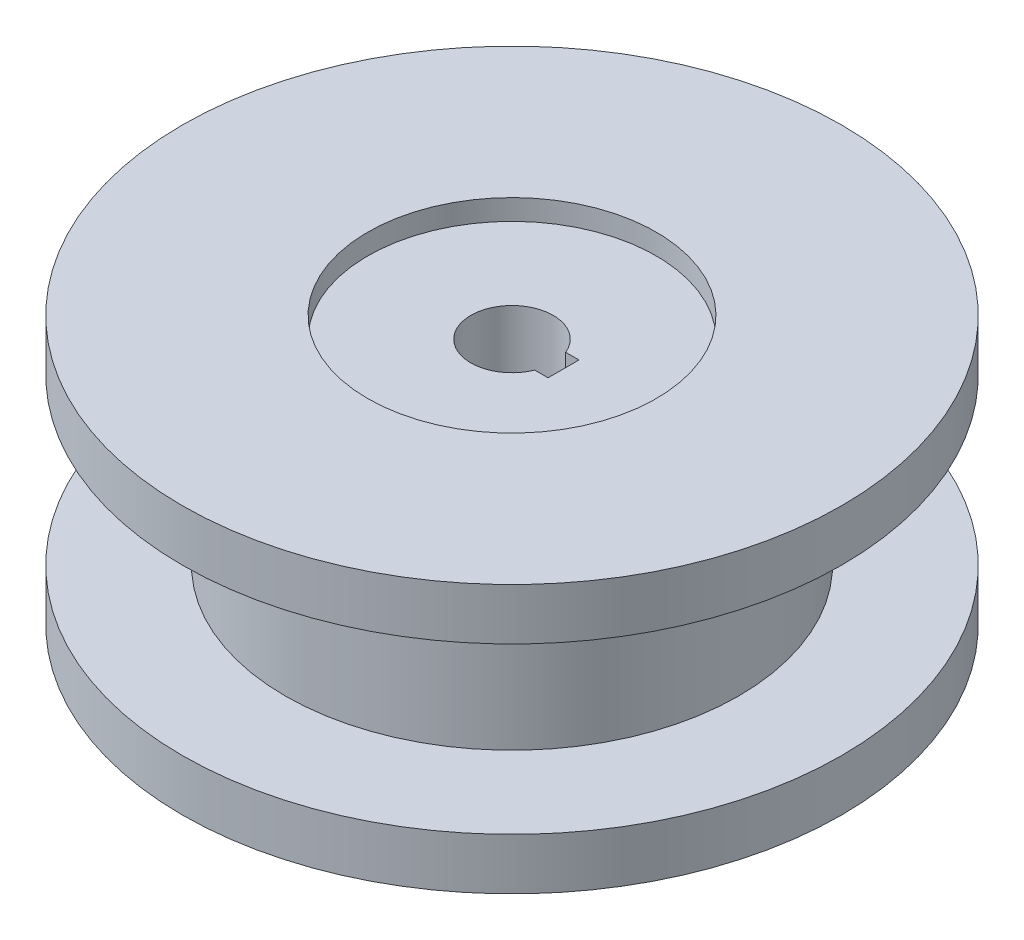
ISO-10303-21;
HEADER;
FILE_DESCRIPTION(('STEP AP214'),'2;1');
FILE_NAME('part.step','',(''),(''),'','','');
FILE_SCHEMA(('AUTOMOTIVE_DESIGN { 1 0 10303 214 1 1 1 1 }'));
ENDSEC;
DATA;
#1=APPLICATION_CONTEXT('core data for automotive mechanical design processes');
#2=APPLICATION_PROTOCOL_DEFINITION('international standard','automotive_design',2000,#1);
#3=PRODUCT_CONTEXT('',#1,'mechanical');
#4=PRODUCT('Part','Part','',(#3));
#5=PRODUCT_RELATED_PRODUCT_CATEGORY('part','',(#4));
#6=PRODUCT_DEFINITION_FORMATION('','',#4);
#7=PRODUCT_DEFINITION_CONTEXT('part definition',#1,'design');
#8=PRODUCT_DEFINITION('design','',#6,#7);
#9=PRODUCT_DEFINITION_SHAPE('','',#8);
#10=(LENGTH_UNIT() NAMED_UNIT(*) SI_UNIT(.MILLI.,.METRE.));
#11=(NAMED_UNIT(*) PLANE_ANGLE_UNIT() SI_UNIT($,.RADIAN.));
#12=(NAMED_UNIT(*) SI_UNIT($,.STERADIAN.) SOLID_ANGLE_UNIT());
#13=UNCERTAINTY_MEASURE_WITH_UNIT(LENGTH_MEASURE(1.E-05),#10,'distance_accuracy_value','');
#14=(GEOMETRIC_REPRESENTATION_CONTEXT(3) GLOBAL_UNCERTAINTY_ASSIGNED_CONTEXT((#13)) GLOBAL_UNIT_ASSIGNED_CONTEXT((#10,
#11,#12)) REPRESENTATION_CONTEXT('',''));
#15=CARTESIAN_POINT('',(0.,0.,0.));
#16=DIRECTION('',(0.,0.,1.));
#17=DIRECTION('',(1.,0.,0.));
#18=AXIS2_PLACEMENT_3D('',#15,#16,#17);
#19=CARTESIAN_POINT('',(0.,-65.,0.));
#20=DIRECTION('',(0.,1.,0.));
#21=DIRECTION('',(0.,0.,1.));
#22=AXIS2_PLACEMENT_3D('',#19,#20,#21);
#23=PLANE('',#22);
#24=CARTESIAN_POINT('',(0.,-65.,0.));
#25=DIRECTION('',(0.,1.,0.));
#26=DIRECTION('',(0.,0.,1.));
#27=AXIS2_PLACEMENT_3D('',#24,#25,#26);
#28=CIRCLE('',#27,70.);
#29=CARTESIAN_POINT('',(0.,-65.,70.));
#30=VERTEX_POINT('',#29);
#31=EDGE_CURVE('E105',#30,#30,#28,.T.);
#32=ORIENTED_EDGE('',*,*,#31,.T.);
#33=EDGE_LOOP('',(#32));
#34=FACE_BOUND('',#33,.T.);
#35=CARTESIAN_POINT('',(0.,-65.,0.));
#36=DIRECTION('',(0.,1.,0.));
#37=DIRECTION('',(0.,0.,1.));
#38=AXIS2_PLACEMENT_3D('',#35,#36,#37);
#39=CIRCLE('',#38,160.);
#40=CARTESIAN_POINT('',(0.,-65.,160.));
#41=VERTEX_POINT('',#40);
#42=EDGE_CURVE('E128',#41,#41,#39,.T.);
#43=ORIENTED_EDGE('',*,*,#42,.F.);
#44=EDGE_LOOP('',(#43));
#45=FACE_BOUND('',#44,.T.);
#46=ADVANCED_FACE('F33',(#34,#45),#23,.F.);
#47=CARTESIAN_POINT('',(0.,93.8108108108108,0.));
#48=DIRECTION('',(0.,1.,0.));
#49=DIRECTION('',(0.,0.,1.));
#50=AXIS2_PLACEMENT_3D('',#47,#48,#49);
#51=CYLINDRICAL_SURFACE('',#50,160.);
#52=CARTESIAN_POINT('',(0.,-40.,0.));
#53=DIRECTION('',(0.,1.,0.));
#54=DIRECTION('',(0.,0.,1.));
#55=AXIS2_PLACEMENT_3D('',#52,#53,#54);
#56=CIRCLE('',#55,160.);
#57=CARTESIAN_POINT('',(0.,-40.,160.));
#58=VERTEX_POINT('',#57);
#59=EDGE_CURVE('E125',#58,#58,#56,.T.);
#60=ORIENTED_EDGE('',*,*,#59,.F.);
#61=EDGE_LOOP('',(#60));
#62=FACE_BOUND('',#61,.T.);
#63=ORIENTED_EDGE('',*,*,#42,.T.);
#64=EDGE_LOOP('',(#63));
#65=FACE_BOUND('',#64,.T.);
#66=ADVANCED_FACE('F150',(#62,#65),#51,.T.);
#67=CARTESIAN_POINT('',(160.,-40.,0.));
#68=DIRECTION('',(0.,-1.,0.));
#69=DIRECTION('',(0.,0.,-1.));
#70=AXIS2_PLACEMENT_3D('',#67,#68,#69);
#71=PLANE('',#70);
#72=CARTESIAN_POINT('',(0.,-40.,0.));
#73=DIRECTION('',(0.,1.,0.));
#74=DIRECTION('',(0.,0.,1.));
#75=AXIS2_PLACEMENT_3D('',#72,#73,#74);
#76=CIRCLE('',#75,110.);
#77=CARTESIAN_POINT('',(0.,-40.,110.));
#78=VERTEX_POINT('',#77);
#79=EDGE_CURVE('E122',#78,#78,#76,.T.);
#80=ORIENTED_EDGE('',*,*,#79,.F.);
#81=EDGE_LOOP('',(#80));
#82=FACE_BOUND('',#81,.T.);
#83=ORIENTED_EDGE('',*,*,#59,.T.);
#84=EDGE_LOOP('',(#83));
#85=FACE_BOUND('',#84,.T.);
#86=ADVANCED_FACE('F155',(#82,#85),#71,.F.);
#87=CARTESIAN_POINT('',(0.,93.8108108108108,0.));
#88=DIRECTION('',(0.,1.,0.));
#89=DIRECTION('',(0.,0.,1.));
#90=AXIS2_PLACEMENT_3D('',#87,#88,#89);
#91=CYLINDRICAL_SURFACE('',#90,110.);
#92=CARTESIAN_POINT('',(0.,40.,0.));
#93=DIRECTION('',(0.,1.,0.));
#94=DIRECTION('',(0.,0.,1.));
#95=AXIS2_PLACEMENT_3D('',#92,#93,#94);
#96=CIRCLE('',#95,110.);
#97=CARTESIAN_POINT('',(0.,40.,110.));
#98=VERTEX_POINT('',#97);
#99=EDGE_CURVE('E119',#98,#98,#96,.T.);
#100=ORIENTED_EDGE('',*,*,#99,.F.);
#101=EDGE_LOOP('',(#100));
#102=FACE_BOUND('',#101,.T.);
#103=ORIENTED_EDGE('',*,*,#79,.T.);
#104=EDGE_LOOP('',(#103));
#105=FACE_BOUND('',#104,.T.);
#106=ADVANCED_FACE('F189',(#102,#105),#91,.T.);
#107=CARTESIAN_POINT('',(160.,40.,0.));
#108=DIRECTION('',(0.,1.,0.));
#109=DIRECTION('',(0.,0.,1.));
#110=AXIS2_PLACEMENT_3D('',#107,#108,#109);
#111=PLANE('',#110);
#112=CARTESIAN_POINT('',(0.,40.,0.));
#113=DIRECTION('',(0.,1.,0.));
#114=DIRECTION('',(0.,0.,1.));
#115=AXIS2_PLACEMENT_3D('',#112,#113,#114);
#116=CIRCLE('',#115,160.);
#117=CARTESIAN_POINT('',(0.,40.,160.));
#118=VERTEX_POINT('',#117);
#119=EDGE_CURVE('E116',#118,#118,#116,.T.);
#120=ORIENTED_EDGE('',*,*,#119,.F.);
#121=EDGE_LOOP('',(#120));
#122=FACE_BOUND('',#121,.T.);
#123=ORIENTED_EDGE('',*,*,#99,.T.);
#124=EDGE_LOOP('',(#123));
#125=FACE_BOUND('',#124,.T.);
#126=ADVANCED_FACE('F185',(#122,#125),#111,.F.);
#127=CARTESIAN_POINT('',(0.,93.8108108108108,0.));
#128=DIRECTION('',(0.,1.,0.));
#129=DIRECTION('',(0.,0.,1.));
#130=AXIS2_PLACEMENT_3D('',#127,#128,#129);
#131=CYLINDRICAL_SURFACE('',#130,160.);
#132=CARTESIAN_POINT('',(0.,65.,0.));
#133=DIRECTION('',(0.,1.,0.));
#134=DIRECTION('',(0.,0.,1.));
#135=AXIS2_PLACEMENT_3D('',#132,#133,#134);
#136=CIRCLE('',#135,160.);
#137=CARTESIAN_POINT('',(0.,65.,160.));
#138=VERTEX_POINT('',#137);
#139=EDGE_CURVE('E111',#138,#138,#136,.T.);
#140=ORIENTED_EDGE('',*,*,#139,.F.);
#141=EDGE_LOOP('',(#140));
#142=FACE_BOUND('',#141,.T.);
#143=ORIENTED_EDGE('',*,*,#119,.T.);
#144=EDGE_LOOP('',(#143));
#145=FACE_BOUND('',#144,.T.);
#146=ADVANCED_FACE('F181',(#142,#145),#131,.T.);
#147=CARTESIAN_POINT('',(0.,65.,0.));
#148=DIRECTION('',(0.,-1.,0.));
#149=DIRECTION('',(0.,0.,-1.));
#150=AXIS2_PLACEMENT_3D('',#147,#148,#149);
#151=PLANE('',#150);
#152=CARTESIAN_POINT('',(0.,65.,0.));
#153=DIRECTION('',(0.,1.,0.));
#154=DIRECTION('',(0.,0.,1.));
#155=AXIS2_PLACEMENT_3D('',#152,#153,#154);
#156=CIRCLE('',#155,70.);
#157=CARTESIAN_POINT('',(0.,65.,70.));
#158=VERTEX_POINT('',#157);
#159=EDGE_CURVE('E104',#158,#158,#156,.T.);
#160=ORIENTED_EDGE('',*,*,#159,.F.);
#161=EDGE_LOOP('',(#160));
#162=FACE_BOUND('',#161,.T.);
#163=ORIENTED_EDGE('',*,*,#139,.T.);
#164=EDGE_LOOP('',(#163));
#165=FACE_BOUND('',#164,.T.);
#166=ADVANCED_FACE('F177',(#162,#165),#151,.F.);
#167=CARTESIAN_POINT('',(0.,55.,0.));
#168=DIRECTION('',(0.,1.,0.));
#169=DIRECTION('',(0.,0.,1.));
#170=AXIS2_PLACEMENT_3D('',#167,#168,#169);
#171=CYLINDRICAL_SURFACE('',#170,70.);
#172=CARTESIAN_POINT('',(0.,55.,0.));
#173=DIRECTION('',(0.,1.,0.));
#174=DIRECTION('',(0.,0.,1.));
#175=AXIS2_PLACEMENT_3D('',#172,#173,#174);
#176=CIRCLE('',#175,70.);
#177=CARTESIAN_POINT('',(0.,55.,70.));
#178=VERTEX_POINT('',#177);
#179=EDGE_CURVE('E108',#178,#178,#176,.T.);
#180=ORIENTED_EDGE('',*,*,#179,.F.);
#181=EDGE_LOOP('',(#180));
#182=FACE_BOUND('',#181,.T.);
#183=ORIENTED_EDGE('',*,*,#159,.T.);
#184=EDGE_LOOP('',(#183));
#185=FACE_BOUND('',#184,.T.);
#186=ADVANCED_FACE('F171',(#182,#185),#171,.F.);
#187=CARTESIAN_POINT('',(0.,55.,0.));
#188=DIRECTION('',(0.,1.,0.));
#189=DIRECTION('',(0.,0.,1.));
#190=AXIS2_PLACEMENT_3D('',#187,#188,#189);
#191=PLANE('',#190);
#192=DIRECTION('',(1.,0.,0.));
#193=VECTOR('',#192,1.);
#194=CARTESIAN_POINT('',(5.54507585140844,55.,7.50000000000002));
#195=LINE('',#194,#193);
#196=CARTESIAN_POINT('',(18.5404962177392,55.,7.50000000000002));
#197=VERTEX_POINT('',#196);
#198=CARTESIAN_POINT('',(25.,55.,7.50000000000002));
#199=VERTEX_POINT('',#198);
#200=EDGE_CURVE('E79',#197,#199,#195,.T.);
#201=ORIENTED_EDGE('',*,*,#200,.F.);
#202=CARTESIAN_POINT('',(0.,55.,0.));
#203=DIRECTION('',(0.,1.,0.));
#204=DIRECTION('',(0.,0.,1.));
#205=AXIS2_PLACEMENT_3D('',#202,#203,#204);
#206=CIRCLE('',#205,20.);
#207=CARTESIAN_POINT('',(18.5404962177392,55.,-7.49999999999998));
#208=VERTEX_POINT('',#207);
#209=EDGE_CURVE('E92',#208,#197,#206,.T.);
#210=ORIENTED_EDGE('',*,*,#209,.F.);
#211=DIRECTION('',(-1.,0.,0.));
#212=VECTOR('',#211,1.);
#213=CARTESIAN_POINT('',(5.54507585140844,55.,-7.49999999999998));
#214=LINE('',#213,#212);
#215=CARTESIAN_POINT('',(25.,55.,-7.49999999999998));
#216=VERTEX_POINT('',#215);
#217=EDGE_CURVE('E47',#216,#208,#214,.T.);
#218=ORIENTED_EDGE('',*,*,#217,.F.);
#219=DIRECTION('',(0.,0.,-1.));
#220=VECTOR('',#219,1.);
#221=CARTESIAN_POINT('',(25.,55.,7.50000000000002));
#222=LINE('',#221,#220);
#223=EDGE_CURVE('E82',#199,#216,#222,.T.);
#224=ORIENTED_EDGE('',*,*,#223,.F.);
#225=EDGE_LOOP('',(#201,#210,#218,#224));
#226=FACE_BOUND('',#225,.T.);
#227=ORIENTED_EDGE('',*,*,#179,.T.);
#228=EDGE_LOOP('',(#227));
#229=FACE_BOUND('',#228,.T.);
#230=ADVANCED_FACE('F89',(#226,#229),#191,.T.);
#231=CARTESIAN_POINT('',(0.,-55.,0.));
#232=DIRECTION('',(0.,-1.,0.));
#233=DIRECTION('',(0.,0.,-1.));
#234=AXIS2_PLACEMENT_3D('',#231,#232,#233);
#235=CYLINDRICAL_SURFACE('',#234,70.);
#236=CARTESIAN_POINT('',(0.,-55.,0.));
#237=DIRECTION('',(0.,1.,0.));
#238=DIRECTION('',(0.,0.,1.));
#239=AXIS2_PLACEMENT_3D('',#236,#237,#238);
#240=CIRCLE('',#239,70.);
#241=CARTESIAN_POINT('',(0.,-55.,70.));
#242=VERTEX_POINT('',#241);
#243=EDGE_CURVE('E101',#242,#242,#240,.T.);
#244=ORIENTED_EDGE('',*,*,#243,.T.);
#245=EDGE_LOOP('',(#244));
#246=FACE_BOUND('',#245,.T.);
#247=ORIENTED_EDGE('',*,*,#31,.F.);
#248=EDGE_LOOP('',(#247));
#249=FACE_BOUND('',#248,.T.);
#250=ADVANCED_FACE('F162',(#246,#249),#235,.F.);
#251=CARTESIAN_POINT('',(0.,-55.,0.));
#252=DIRECTION('',(0.,-1.,0.));
#253=DIRECTION('',(0.,0.,1.));
#254=AXIS2_PLACEMENT_3D('',#251,#252,#253);
#255=PLANE('',#254);
#256=DIRECTION('',(-1.,0.,0.));
#257=VECTOR('',#256,1.);
#258=CARTESIAN_POINT('',(0.,-55.,7.50000000000002));
#259=LINE('',#258,#257);
#260=CARTESIAN_POINT('',(25.,-55.,7.50000000000002));
#261=VERTEX_POINT('',#260);
#262=CARTESIAN_POINT('',(18.5404962177392,-55.,7.50000000000002));
#263=VERTEX_POINT('',#262);
#264=EDGE_CURVE('E55',#261,#263,#259,.T.);
#265=ORIENTED_EDGE('',*,*,#264,.F.);
#266=DIRECTION('',(0.,0.,1.));
#267=VECTOR('',#266,1.);
#268=CARTESIAN_POINT('',(25.,-55.,0.));
#269=LINE('',#268,#267);
#270=CARTESIAN_POINT('',(25.,-55.,-7.49999999999998));
#271=VERTEX_POINT('',#270);
#272=EDGE_CURVE('E11',#271,#261,#269,.T.);
#273=ORIENTED_EDGE('',*,*,#272,.F.);
#274=DIRECTION('',(1.,0.,0.));
#275=VECTOR('',#274,1.);
#276=CARTESIAN_POINT('',(0.,-55.,-7.49999999999998));
#277=LINE('',#276,#275);
#278=CARTESIAN_POINT('',(18.5404962177392,-55.,-7.49999999999998));
#279=VERTEX_POINT('',#278);
#280=EDGE_CURVE('E75',#279,#271,#277,.T.);
#281=ORIENTED_EDGE('',*,*,#280,.F.);
#282=CARTESIAN_POINT('',(0.,-55.,0.));
#283=DIRECTION('',(0.,-1.,0.));
#284=DIRECTION('',(0.,0.,-1.));
#285=AXIS2_PLACEMENT_3D('',#282,#283,#284);
#286=CIRCLE('',#285,20.);
#287=EDGE_CURVE('E100',#263,#279,#286,.T.);
#288=ORIENTED_EDGE('',*,*,#287,.F.);
#289=EDGE_LOOP('',(#265,#273,#281,#288));
#290=FACE_BOUND('',#289,.T.);
#291=ORIENTED_EDGE('',*,*,#243,.F.);
#292=EDGE_LOOP('',(#291));
#293=FACE_BOUND('',#292,.T.);
#294=ADVANCED_FACE('F138',(#290,#293),#255,.T.);
#295=CARTESIAN_POINT('',(0.,-65.,0.));
#296=DIRECTION('',(0.,1.,0.));
#297=DIRECTION('',(0.,0.,1.));
#298=AXIS2_PLACEMENT_3D('',#295,#296,#297);
#299=CYLINDRICAL_SURFACE('',#298,20.);
#300=ORIENTED_EDGE('',*,*,#209,.T.);
#301=DIRECTION('',(0.,1.,0.));
#302=VECTOR('',#301,1.);
#303=CARTESIAN_POINT('',(18.5404962177392,-65.,7.50000000000002));
#304=LINE('',#303,#302);
#305=EDGE_CURVE('E40',#197,#263,#304,.F.);
#306=ORIENTED_EDGE('',*,*,#305,.T.);
#307=ORIENTED_EDGE('',*,*,#287,.T.);
#308=DIRECTION('',(0.,1.,0.));
#309=VECTOR('',#308,1.);
#310=CARTESIAN_POINT('',(18.5404962177392,-65.,-7.49999999999998));
#311=LINE('',#310,#309);
#312=EDGE_CURVE('E131',#279,#208,#311,.T.);
#313=ORIENTED_EDGE('',*,*,#312,.T.);
#314=EDGE_LOOP('',(#300,#306,#307,#313));
#315=FACE_BOUND('',#314,.T.);
#316=ADVANCED_FACE('F136',(#315),#299,.F.);
#317=CARTESIAN_POINT('',(25.,-65.,7.50000000000002));
#318=DIRECTION('',(1.,0.,0.));
#319=DIRECTION('',(0.,0.,-1.));
#320=AXIS2_PLACEMENT_3D('',#317,#318,#319);
#321=PLANE('',#320);
#322=ORIENTED_EDGE('',*,*,#272,.T.);
#323=DIRECTION('',(0.,1.,0.));
#324=VECTOR('',#323,1.);
#325=CARTESIAN_POINT('',(25.,-65.,7.50000000000002));
#326=LINE('',#325,#324);
#327=EDGE_CURVE('E78',#261,#199,#326,.T.);
#328=ORIENTED_EDGE('',*,*,#327,.T.);
#329=ORIENTED_EDGE('',*,*,#223,.T.);
#330=DIRECTION('',(0.,1.,0.));
#331=VECTOR('',#330,1.);
#332=CARTESIAN_POINT('',(25.,-65.,-7.49999999999998));
#333=LINE('',#332,#331);
#334=EDGE_CURVE('E71',#271,#216,#333,.T.);
#335=ORIENTED_EDGE('',*,*,#334,.F.);
#336=EDGE_LOOP('',(#322,#328,#329,#335));
#337=FACE_BOUND('',#336,.T.);
#338=ADVANCED_FACE('F83',(#337),#321,.F.);
#339=CARTESIAN_POINT('',(5.54507585140844,-65.,7.50000000000002));
#340=DIRECTION('',(0.,0.,1.));
#341=DIRECTION('',(1.,0.,0.));
#342=AXIS2_PLACEMENT_3D('',#339,#340,#341);
#343=PLANE('',#342);
#344=ORIENTED_EDGE('',*,*,#264,.T.);
#345=ORIENTED_EDGE('',*,*,#305,.F.);
#346=ORIENTED_EDGE('',*,*,#200,.T.);
#347=ORIENTED_EDGE('',*,*,#327,.F.);
#348=EDGE_LOOP('',(#344,#345,#346,#347));
#349=FACE_BOUND('',#348,.T.);
#350=ADVANCED_FACE('F140',(#349),#343,.F.);
#351=CARTESIAN_POINT('',(5.54507585140844,-65.,-7.49999999999998));
#352=DIRECTION('',(0.,0.,-1.));
#353=DIRECTION('',(-1.,0.,0.));
#354=AXIS2_PLACEMENT_3D('',#351,#352,#353);
#355=PLANE('',#354);
#356=ORIENTED_EDGE('',*,*,#280,.T.);
#357=ORIENTED_EDGE('',*,*,#334,.T.);
#358=ORIENTED_EDGE('',*,*,#217,.T.);
#359=ORIENTED_EDGE('',*,*,#312,.F.);
#360=EDGE_LOOP('',(#356,#357,#358,#359));
#361=FACE_BOUND('',#360,.T.);
#362=ADVANCED_FACE('F73',(#361),#355,.F.);
#363=CLOSED_SHELL('',(#46,#66,#86,#106,#126,#146,#166,#186,#230,#250,#294,#316,#338,#350,#362));
#364=MANIFOLD_SOLID_BREP('B2',#363);
#365=ADVANCED_BREP_SHAPE_REPRESENTATION('',(#18,#364),#14);
#366=SHAPE_DEFINITION_REPRESENTATION(#9,#365);
ENDSEC;
END-ISO-10303-21;
